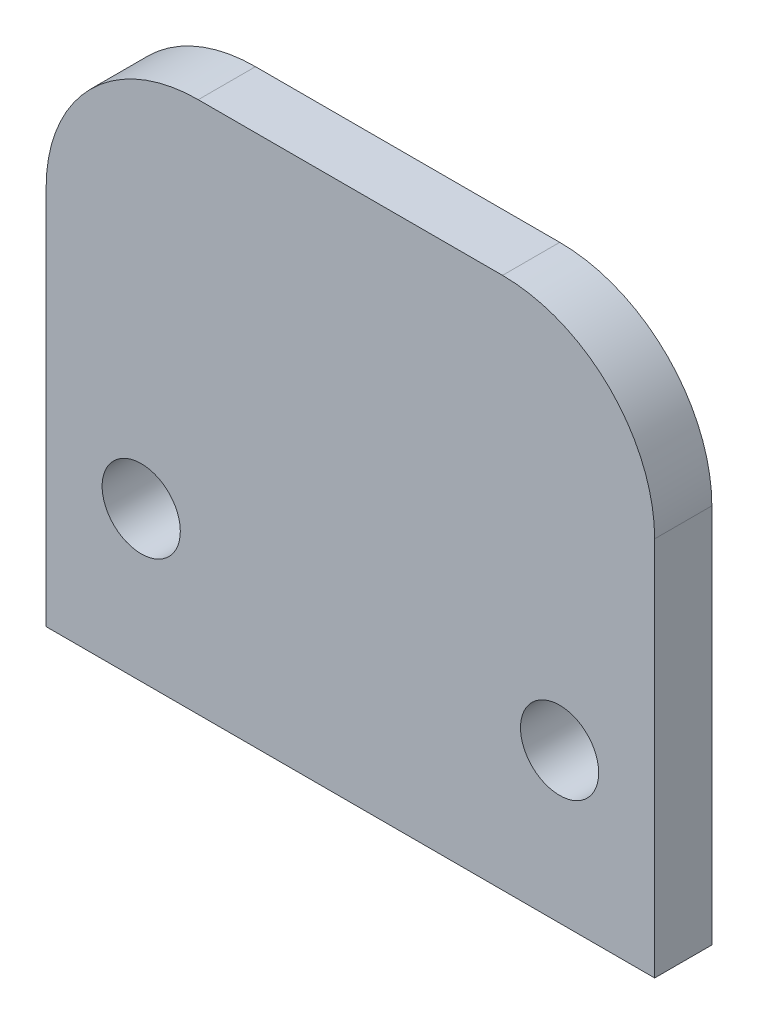
ISO-10303-21;
HEADER;
FILE_DESCRIPTION(('STEP AP214'),'2;1');
FILE_NAME('part.step','',(''),(''),'','','');
FILE_SCHEMA(('AUTOMOTIVE_DESIGN { 1 0 10303 214 1 1 1 1 }'));
ENDSEC;
DATA;
#1=APPLICATION_CONTEXT('core data for automotive mechanical design processes');
#2=APPLICATION_PROTOCOL_DEFINITION('international standard','automotive_design',2000,#1);
#3=PRODUCT_CONTEXT('',#1,'mechanical');
#4=PRODUCT('Part','Part','',(#3));
#5=PRODUCT_RELATED_PRODUCT_CATEGORY('part','',(#4));
#6=PRODUCT_DEFINITION_FORMATION('','',#4);
#7=PRODUCT_DEFINITION_CONTEXT('part definition',#1,'design');
#8=PRODUCT_DEFINITION('design','',#6,#7);
#9=PRODUCT_DEFINITION_SHAPE('','',#8);
#10=(LENGTH_UNIT() NAMED_UNIT(*) SI_UNIT(.MILLI.,.METRE.));
#11=(NAMED_UNIT(*) PLANE_ANGLE_UNIT() SI_UNIT($,.RADIAN.));
#12=(NAMED_UNIT(*) SI_UNIT($,.STERADIAN.) SOLID_ANGLE_UNIT());
#13=UNCERTAINTY_MEASURE_WITH_UNIT(LENGTH_MEASURE(1.E-05),#10,'distance_accuracy_value','');
#14=(GEOMETRIC_REPRESENTATION_CONTEXT(3) GLOBAL_UNCERTAINTY_ASSIGNED_CONTEXT((#13)) GLOBAL_UNIT_ASSIGNED_CONTEXT((#10,
#11,#12)) REPRESENTATION_CONTEXT('',''));
#15=CARTESIAN_POINT('',(0.,0.,0.));
#16=DIRECTION('',(0.,0.,1.));
#17=DIRECTION('',(1.,0.,0.));
#18=AXIS2_PLACEMENT_3D('',#15,#16,#17);
#19=CARTESIAN_POINT('',(0.,0.,2.3876));
#20=DIRECTION('',(0.,0.,-1.));
#21=DIRECTION('',(-1.,0.,0.));
#22=AXIS2_PLACEMENT_3D('',#19,#20,#21);
#23=PLANE('',#22);
#24=CARTESIAN_POINT('',(-17.4625,12.4968,2.3876));
#25=DIRECTION('',(0.,0.,1.));
#26=DIRECTION('',(1.,0.,0.));
#27=AXIS2_PLACEMENT_3D('',#24,#25,#26);
#28=CIRCLE('',#27,3.26389999999999);
#29=CARTESIAN_POINT('',(-14.1986,12.4968,2.3876));
#30=VERTEX_POINT('',#29);
#31=EDGE_CURVE('E181',#30,#30,#28,.T.);
#32=ORIENTED_EDGE('',*,*,#31,.F.);
#33=EDGE_LOOP('',(#32));
#34=FACE_BOUND('',#33,.T.);
#35=DIRECTION('',(0.,1.,0.));
#36=VECTOR('',#35,1.);
#37=CARTESIAN_POINT('',(25.4,0.,2.3876));
#38=LINE('',#37,#36);
#39=CARTESIAN_POINT('',(25.4,0.,2.3876));
#40=VERTEX_POINT('',#39);
#41=CARTESIAN_POINT('',(25.4,31.75,2.3876));
#42=VERTEX_POINT('',#41);
#43=EDGE_CURVE('E111',#40,#42,#38,.T.);
#44=ORIENTED_EDGE('',*,*,#43,.T.);
#45=CARTESIAN_POINT('',(12.7,31.75,2.3876));
#46=DIRECTION('',(0.,0.,-1.));
#47=DIRECTION('',(-1.,0.,0.));
#48=AXIS2_PLACEMENT_3D('',#45,#46,#47);
#49=CIRCLE('',#48,12.7);
#50=CARTESIAN_POINT('',(12.7,44.45,2.3876));
#51=VERTEX_POINT('',#50);
#52=EDGE_CURVE('E48',#42,#51,#49,.F.);
#53=ORIENTED_EDGE('',*,*,#52,.T.);
#54=DIRECTION('',(-1.,0.,0.));
#55=VECTOR('',#54,1.);
#56=CARTESIAN_POINT('',(-25.4,44.45,2.3876));
#57=LINE('',#56,#55);
#58=CARTESIAN_POINT('',(-12.7,44.45,2.3876));
#59=VERTEX_POINT('',#58);
#60=EDGE_CURVE('E124',#51,#59,#57,.T.);
#61=ORIENTED_EDGE('',*,*,#60,.T.);
#62=CARTESIAN_POINT('',(-12.7,31.75,2.3876));
#63=DIRECTION('',(0.,0.,-1.));
#64=DIRECTION('',(-1.,0.,0.));
#65=AXIS2_PLACEMENT_3D('',#62,#63,#64);
#66=CIRCLE('',#65,12.7);
#67=CARTESIAN_POINT('',(-25.4,31.75,2.3876));
#68=VERTEX_POINT('',#67);
#69=EDGE_CURVE('E55',#59,#68,#66,.F.);
#70=ORIENTED_EDGE('',*,*,#69,.T.);
#71=DIRECTION('',(0.,-1.,0.));
#72=VECTOR('',#71,1.);
#73=CARTESIAN_POINT('',(-25.4,0.,2.3876));
#74=LINE('',#73,#72);
#75=CARTESIAN_POINT('',(-25.4,0.,2.3876));
#76=VERTEX_POINT('',#75);
#77=EDGE_CURVE('E93',#68,#76,#74,.T.);
#78=ORIENTED_EDGE('',*,*,#77,.T.);
#79=DIRECTION('',(1.,0.,0.));
#80=VECTOR('',#79,1.);
#81=CARTESIAN_POINT('',(-25.4,0.,2.3876));
#82=LINE('',#81,#80);
#83=EDGE_CURVE('E96',#76,#40,#82,.T.);
#84=ORIENTED_EDGE('',*,*,#83,.T.);
#85=EDGE_LOOP('',(#44,#53,#61,#70,#78,#84));
#86=FACE_BOUND('',#85,.T.);
#87=CARTESIAN_POINT('',(17.4625,12.4968,2.3876));
#88=DIRECTION('',(0.,0.,1.));
#89=DIRECTION('',(1.,0.,0.));
#90=AXIS2_PLACEMENT_3D('',#87,#88,#89);
#91=CIRCLE('',#90,3.26389999999999);
#92=CARTESIAN_POINT('',(20.7264,12.4968,2.3876));
#93=VERTEX_POINT('',#92);
#94=EDGE_CURVE('E173',#93,#93,#91,.T.);
#95=ORIENTED_EDGE('',*,*,#94,.F.);
#96=EDGE_LOOP('',(#95));
#97=FACE_BOUND('',#96,.T.);
#98=ADVANCED_FACE('F39',(#34,#86,#97),#23,.F.);
#99=CARTESIAN_POINT('',(-25.4,0.,2.3876));
#100=DIRECTION('',(1.,0.,0.));
#101=DIRECTION('',(0.,0.,-1.));
#102=AXIS2_PLACEMENT_3D('',#99,#100,#101);
#103=PLANE('',#102);
#104=ORIENTED_EDGE('',*,*,#77,.F.);
#105=DIRECTION('',(0.,0.,-1.));
#106=VECTOR('',#105,1.);
#107=CARTESIAN_POINT('',(-25.4,31.75,2.3876));
#108=LINE('',#107,#106);
#109=CARTESIAN_POINT('',(-25.4,31.75,-2.3876));
#110=VERTEX_POINT('',#109);
#111=EDGE_CURVE('E11',#68,#110,#108,.T.);
#112=ORIENTED_EDGE('',*,*,#111,.T.);
#113=DIRECTION('',(0.,-1.,0.));
#114=VECTOR('',#113,1.);
#115=CARTESIAN_POINT('',(-25.4,0.,-2.3876));
#116=LINE('',#115,#114);
#117=CARTESIAN_POINT('',(-25.4,0.,-2.3876));
#118=VERTEX_POINT('',#117);
#119=EDGE_CURVE('E115',#110,#118,#116,.T.);
#120=ORIENTED_EDGE('',*,*,#119,.T.);
#121=DIRECTION('',(0.,0.,-1.));
#122=VECTOR('',#121,1.);
#123=CARTESIAN_POINT('',(-25.4,0.,2.3876));
#124=LINE('',#123,#122);
#125=EDGE_CURVE('E107',#76,#118,#124,.T.);
#126=ORIENTED_EDGE('',*,*,#125,.F.);
#127=EDGE_LOOP('',(#104,#112,#120,#126));
#128=FACE_BOUND('',#127,.T.);
#129=ADVANCED_FACE('F113',(#128),#103,.F.);
#130=CARTESIAN_POINT('',(-25.4,0.,2.3876));
#131=DIRECTION('',(0.,1.,0.));
#132=DIRECTION('',(0.,0.,1.));
#133=AXIS2_PLACEMENT_3D('',#130,#131,#132);
#134=PLANE('',#133);
#135=DIRECTION('',(1.,0.,0.));
#136=VECTOR('',#135,1.);
#137=CARTESIAN_POINT('',(-25.4,0.,-2.3876));
#138=LINE('',#137,#136);
#139=CARTESIAN_POINT('',(25.4,0.,-2.3876));
#140=VERTEX_POINT('',#139);
#141=EDGE_CURVE('E159',#118,#140,#138,.T.);
#142=ORIENTED_EDGE('',*,*,#141,.T.);
#143=DIRECTION('',(0.,0.,-1.));
#144=VECTOR('',#143,1.);
#145=CARTESIAN_POINT('',(25.4,0.,2.3876));
#146=LINE('',#145,#144);
#147=EDGE_CURVE('E109',#40,#140,#146,.T.);
#148=ORIENTED_EDGE('',*,*,#147,.F.);
#149=ORIENTED_EDGE('',*,*,#83,.F.);
#150=ORIENTED_EDGE('',*,*,#125,.T.);
#151=EDGE_LOOP('',(#142,#148,#149,#150));
#152=FACE_BOUND('',#151,.T.);
#153=ADVANCED_FACE('F106',(#152),#134,.F.);
#154=CARTESIAN_POINT('',(25.4,0.,2.3876));
#155=DIRECTION('',(-1.,0.,0.));
#156=DIRECTION('',(0.,0.,1.));
#157=AXIS2_PLACEMENT_3D('',#154,#155,#156);
#158=PLANE('',#157);
#159=DIRECTION('',(0.,1.,0.));
#160=VECTOR('',#159,1.);
#161=CARTESIAN_POINT('',(25.4,0.,-2.3876));
#162=LINE('',#161,#160);
#163=CARTESIAN_POINT('',(25.4,31.75,-2.3876));
#164=VERTEX_POINT('',#163);
#165=EDGE_CURVE('E156',#140,#164,#162,.T.);
#166=ORIENTED_EDGE('',*,*,#165,.T.);
#167=DIRECTION('',(0.,0.,-1.));
#168=VECTOR('',#167,1.);
#169=CARTESIAN_POINT('',(25.4,31.75,2.3876));
#170=LINE('',#169,#168);
#171=EDGE_CURVE('E63',#164,#42,#170,.F.);
#172=ORIENTED_EDGE('',*,*,#171,.T.);
#173=ORIENTED_EDGE('',*,*,#43,.F.);
#174=ORIENTED_EDGE('',*,*,#147,.T.);
#175=EDGE_LOOP('',(#166,#172,#173,#174));
#176=FACE_BOUND('',#175,.T.);
#177=ADVANCED_FACE('F157',(#176),#158,.F.);
#178=CARTESIAN_POINT('',(-25.4,44.45,2.3876));
#179=DIRECTION('',(0.,-1.,0.));
#180=DIRECTION('',(0.,0.,-1.));
#181=AXIS2_PLACEMENT_3D('',#178,#179,#180);
#182=PLANE('',#181);
#183=ORIENTED_EDGE('',*,*,#60,.F.);
#184=DIRECTION('',(0.,0.,-1.));
#185=VECTOR('',#184,1.);
#186=CARTESIAN_POINT('',(12.7,44.45,2.3876));
#187=LINE('',#186,#185);
#188=CARTESIAN_POINT('',(12.7,44.45,-2.3876));
#189=VERTEX_POINT('',#188);
#190=EDGE_CURVE('E122',#51,#189,#187,.T.);
#191=ORIENTED_EDGE('',*,*,#190,.T.);
#192=DIRECTION('',(-1.,0.,0.));
#193=VECTOR('',#192,1.);
#194=CARTESIAN_POINT('',(-25.4,44.45,-2.3876));
#195=LINE('',#194,#193);
#196=CARTESIAN_POINT('',(-12.7,44.45,-2.3876));
#197=VERTEX_POINT('',#196);
#198=EDGE_CURVE('E102',#189,#197,#195,.T.);
#199=ORIENTED_EDGE('',*,*,#198,.T.);
#200=DIRECTION('',(0.,0.,-1.));
#201=VECTOR('',#200,1.);
#202=CARTESIAN_POINT('',(-12.7,44.45,2.3876));
#203=LINE('',#202,#201);
#204=EDGE_CURVE('E118',#197,#59,#203,.F.);
#205=ORIENTED_EDGE('',*,*,#204,.T.);
#206=EDGE_LOOP('',(#183,#191,#199,#205));
#207=FACE_BOUND('',#206,.T.);
#208=ADVANCED_FACE('F146',(#207),#182,.F.);
#209=CARTESIAN_POINT('',(0.,0.,-2.3876));
#210=DIRECTION('',(0.,0.,-1.));
#211=DIRECTION('',(-1.,0.,0.));
#212=AXIS2_PLACEMENT_3D('',#209,#210,#211);
#213=PLANE('',#212);
#214=CARTESIAN_POINT('',(-17.4625,12.4968,-2.38759999999999));
#215=DIRECTION('',(0.,0.,1.));
#216=DIRECTION('',(1.,0.,0.));
#217=AXIS2_PLACEMENT_3D('',#214,#215,#216);
#218=CIRCLE('',#217,3.26389999999999);
#219=CARTESIAN_POINT('',(-14.1986,12.4968,-2.38759999999999));
#220=VERTEX_POINT('',#219);
#221=EDGE_CURVE('E177',#220,#220,#218,.T.);
#222=ORIENTED_EDGE('',*,*,#221,.T.);
#223=EDGE_LOOP('',(#222));
#224=FACE_BOUND('',#223,.T.);
#225=CARTESIAN_POINT('',(17.4625,12.4968,-2.38759999999999));
#226=DIRECTION('',(0.,0.,1.));
#227=DIRECTION('',(1.,0.,0.));
#228=AXIS2_PLACEMENT_3D('',#225,#226,#227);
#229=CIRCLE('',#228,3.26389999999999);
#230=CARTESIAN_POINT('',(20.7264,12.4968,-2.38759999999999));
#231=VERTEX_POINT('',#230);
#232=EDGE_CURVE('E166',#231,#231,#229,.T.);
#233=ORIENTED_EDGE('',*,*,#232,.T.);
#234=EDGE_LOOP('',(#233));
#235=FACE_BOUND('',#234,.T.);
#236=ORIENTED_EDGE('',*,*,#198,.F.);
#237=CARTESIAN_POINT('',(12.7,31.75,-2.3876));
#238=DIRECTION('',(0.,0.,-1.));
#239=DIRECTION('',(-1.,0.,0.));
#240=AXIS2_PLACEMENT_3D('',#237,#238,#239);
#241=CIRCLE('',#240,12.7);
#242=EDGE_CURVE('E134',#189,#164,#241,.T.);
#243=ORIENTED_EDGE('',*,*,#242,.T.);
#244=ORIENTED_EDGE('',*,*,#165,.F.);
#245=ORIENTED_EDGE('',*,*,#141,.F.);
#246=ORIENTED_EDGE('',*,*,#119,.F.);
#247=CARTESIAN_POINT('',(-12.7,31.75,-2.3876));
#248=DIRECTION('',(0.,0.,-1.));
#249=DIRECTION('',(-1.,0.,0.));
#250=AXIS2_PLACEMENT_3D('',#247,#248,#249);
#251=CIRCLE('',#250,12.7);
#252=EDGE_CURVE('E131',#110,#197,#251,.T.);
#253=ORIENTED_EDGE('',*,*,#252,.T.);
#254=EDGE_LOOP('',(#236,#243,#244,#245,#246,#253));
#255=FACE_BOUND('',#254,.T.);
#256=ADVANCED_FACE('F155',(#224,#235,#255),#213,.T.);
#257=CARTESIAN_POINT('',(17.4625,12.4968,2.3876));
#258=DIRECTION('',(0.,0.,1.));
#259=DIRECTION('',(1.,0.,0.));
#260=AXIS2_PLACEMENT_3D('',#257,#258,#259);
#261=CYLINDRICAL_SURFACE('',#260,3.26389999999999);
#262=ORIENTED_EDGE('',*,*,#232,.F.);
#263=EDGE_LOOP('',(#262));
#264=FACE_BOUND('',#263,.T.);
#265=ORIENTED_EDGE('',*,*,#94,.T.);
#266=EDGE_LOOP('',(#265));
#267=FACE_BOUND('',#266,.T.);
#268=ADVANCED_FACE('F196',(#264,#267),#261,.F.);
#269=CARTESIAN_POINT('',(-17.4625,12.4968,2.3876));
#270=DIRECTION('',(0.,0.,1.));
#271=DIRECTION('',(1.,0.,0.));
#272=AXIS2_PLACEMENT_3D('',#269,#270,#271);
#273=CYLINDRICAL_SURFACE('',#272,3.26389999999999);
#274=ORIENTED_EDGE('',*,*,#221,.F.);
#275=EDGE_LOOP('',(#274));
#276=FACE_BOUND('',#275,.T.);
#277=ORIENTED_EDGE('',*,*,#31,.T.);
#278=EDGE_LOOP('',(#277));
#279=FACE_BOUND('',#278,.T.);
#280=ADVANCED_FACE('F186',(#276,#279),#273,.F.);
#281=CARTESIAN_POINT('',(12.7,31.75,2.3876));
#282=DIRECTION('',(0.,0.,-1.));
#283=DIRECTION('',(-1.,0.,0.));
#284=AXIS2_PLACEMENT_3D('',#281,#282,#283);
#285=CYLINDRICAL_SURFACE('',#284,12.7);
#286=ORIENTED_EDGE('',*,*,#52,.F.);
#287=ORIENTED_EDGE('',*,*,#171,.F.);
#288=ORIENTED_EDGE('',*,*,#242,.F.);
#289=ORIENTED_EDGE('',*,*,#190,.F.);
#290=EDGE_LOOP('',(#286,#287,#288,#289));
#291=FACE_BOUND('',#290,.T.);
#292=ADVANCED_FACE('F152',(#291),#285,.T.);
#293=CARTESIAN_POINT('',(-12.7,31.75,2.3876));
#294=DIRECTION('',(0.,0.,-1.));
#295=DIRECTION('',(-1.,0.,0.));
#296=AXIS2_PLACEMENT_3D('',#293,#294,#295);
#297=CYLINDRICAL_SURFACE('',#296,12.7);
#298=ORIENTED_EDGE('',*,*,#69,.F.);
#299=ORIENTED_EDGE('',*,*,#204,.F.);
#300=ORIENTED_EDGE('',*,*,#252,.F.);
#301=ORIENTED_EDGE('',*,*,#111,.F.);
#302=EDGE_LOOP('',(#298,#299,#300,#301));
#303=FACE_BOUND('',#302,.T.);
#304=ADVANCED_FACE('F41',(#303),#297,.T.);
#305=CLOSED_SHELL('',(#98,#129,#153,#177,#208,#256,#268,#280,#292,#304));
#306=MANIFOLD_SOLID_BREP('B2',#305);
#307=ADVANCED_BREP_SHAPE_REPRESENTATION('',(#18,#306),#14);
#308=SHAPE_DEFINITION_REPRESENTATION(#9,#307);
ENDSEC;
END-ISO-10303-21;
